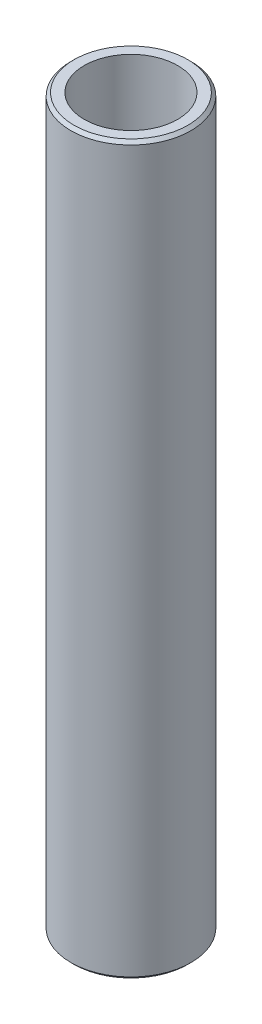
ISO-10303-21;
HEADER;
FILE_DESCRIPTION(('STEP AP214'),'2;1');
FILE_NAME('part.step','',(''),(''),'','','');
FILE_SCHEMA(('AUTOMOTIVE_DESIGN { 1 0 10303 214 1 1 1 1 }'));
ENDSEC;
DATA;
#1=APPLICATION_CONTEXT('core data for automotive mechanical design processes');
#2=APPLICATION_PROTOCOL_DEFINITION('international standard','automotive_design',2000,#1);
#3=PRODUCT_CONTEXT('',#1,'mechanical');
#4=PRODUCT('Part','Part','',(#3));
#5=PRODUCT_RELATED_PRODUCT_CATEGORY('part','',(#4));
#6=PRODUCT_DEFINITION_FORMATION('','',#4);
#7=PRODUCT_DEFINITION_CONTEXT('part definition',#1,'design');
#8=PRODUCT_DEFINITION('design','',#6,#7);
#9=PRODUCT_DEFINITION_SHAPE('','',#8);
#10=(LENGTH_UNIT() NAMED_UNIT(*) SI_UNIT(.MILLI.,.METRE.));
#11=(NAMED_UNIT(*) PLANE_ANGLE_UNIT() SI_UNIT($,.RADIAN.));
#12=(NAMED_UNIT(*) SI_UNIT($,.STERADIAN.) SOLID_ANGLE_UNIT());
#13=UNCERTAINTY_MEASURE_WITH_UNIT(LENGTH_MEASURE(1.E-05),#10,'distance_accuracy_value','');
#14=(GEOMETRIC_REPRESENTATION_CONTEXT(3) GLOBAL_UNCERTAINTY_ASSIGNED_CONTEXT((#13)) GLOBAL_UNIT_ASSIGNED_CONTEXT((#10,
#11,#12)) REPRESENTATION_CONTEXT('',''));
#15=CARTESIAN_POINT('',(0.,0.,0.));
#16=DIRECTION('',(0.,0.,1.));
#17=DIRECTION('',(1.,0.,0.));
#18=AXIS2_PLACEMENT_3D('',#15,#16,#17);
#19=CARTESIAN_POINT('',(0.,575.080637055339,0.));
#20=DIRECTION('',(0.,-1.,0.));
#21=DIRECTION('',(0.,0.,-1.));
#22=AXIS2_PLACEMENT_3D('',#19,#20,#21);
#23=CYLINDRICAL_SURFACE('',#22,47.5);
#24=CARTESIAN_POINT('',(0.,572.61060510153,0.));
#25=DIRECTION('',(0.,1.,0.));
#26=DIRECTION('',(0.,0.,1.));
#27=AXIS2_PLACEMENT_3D('',#24,#25,#26);
#28=CIRCLE('',#27,47.5);
#29=CARTESIAN_POINT('',(0.,572.61060510153,47.5));
#30=VERTEX_POINT('',#29);
#31=EDGE_CURVE('E50',#30,#30,#28,.F.);
#32=ORIENTED_EDGE('',*,*,#31,.T.);
#33=EDGE_LOOP('',(#32));
#34=FACE_BOUND('',#33,.T.);
#35=CARTESIAN_POINT('',(0.,2.47003195380902,0.));
#36=DIRECTION('',(0.,1.,0.));
#37=DIRECTION('',(0.,0.,1.));
#38=AXIS2_PLACEMENT_3D('',#35,#36,#37);
#39=CIRCLE('',#38,47.5);
#40=CARTESIAN_POINT('',(0.,2.47003195380902,47.5));
#41=VERTEX_POINT('',#40);
#42=EDGE_CURVE('E51',#41,#41,#39,.T.);
#43=ORIENTED_EDGE('',*,*,#42,.T.);
#44=EDGE_LOOP('',(#43));
#45=FACE_BOUND('',#44,.T.);
#46=ADVANCED_FACE('F39',(#34,#45),#23,.T.);
#47=CARTESIAN_POINT('',(0.,575.080637055339,0.));
#48=DIRECTION('',(0.,1.,0.));
#49=DIRECTION('',(0.,0.,1.));
#50=AXIS2_PLACEMENT_3D('',#47,#48,#49);
#51=PLANE('',#50);
#52=CARTESIAN_POINT('',(0.,575.080637055339,0.));
#53=DIRECTION('',(0.,1.,0.));
#54=DIRECTION('',(0.,0.,1.));
#55=AXIS2_PLACEMENT_3D('',#52,#53,#54);
#56=CIRCLE('',#55,45.0299680461909);
#57=CARTESIAN_POINT('',(0.,575.080637055339,45.0299680461909));
#58=VERTEX_POINT('',#57);
#59=EDGE_CURVE('E54',#58,#58,#56,.T.);
#60=ORIENTED_EDGE('',*,*,#59,.T.);
#61=EDGE_LOOP('',(#60));
#62=FACE_BOUND('',#61,.T.);
#63=CARTESIAN_POINT('',(0.,575.080637055339,0.));
#64=DIRECTION('',(0.,1.,0.));
#65=DIRECTION('',(0.,0.,1.));
#66=AXIS2_PLACEMENT_3D('',#63,#64,#65);
#67=CIRCLE('',#66,36.9737951186842);
#68=CARTESIAN_POINT('',(0.,575.080637055339,36.9737951186842));
#69=VERTEX_POINT('',#68);
#70=EDGE_CURVE('E58',#69,#69,#67,.T.);
#71=ORIENTED_EDGE('',*,*,#70,.F.);
#72=EDGE_LOOP('',(#71));
#73=FACE_BOUND('',#72,.T.);
#74=ADVANCED_FACE('F69',(#62,#73),#51,.T.);
#75=CARTESIAN_POINT('',(0.,0.,0.));
#76=DIRECTION('',(0.,1.,0.));
#77=DIRECTION('',(0.,0.,1.));
#78=AXIS2_PLACEMENT_3D('',#75,#76,#77);
#79=PLANE('',#78);
#80=CARTESIAN_POINT('',(0.,0.,0.));
#81=DIRECTION('',(0.,1.,0.));
#82=DIRECTION('',(0.,0.,1.));
#83=AXIS2_PLACEMENT_3D('',#80,#81,#82);
#84=CIRCLE('',#83,45.029968046191);
#85=CARTESIAN_POINT('',(0.,0.,45.029968046191));
#86=VERTEX_POINT('',#85);
#87=EDGE_CURVE('E10',#86,#86,#84,.F.);
#88=ORIENTED_EDGE('',*,*,#87,.T.);
#89=EDGE_LOOP('',(#88));
#90=FACE_BOUND('',#89,.T.);
#91=CARTESIAN_POINT('',(0.,0.,0.));
#92=DIRECTION('',(0.,1.,0.));
#93=DIRECTION('',(0.,0.,1.));
#94=AXIS2_PLACEMENT_3D('',#91,#92,#93);
#95=CIRCLE('',#94,36.9737951186842);
#96=CARTESIAN_POINT('',(0.,0.,36.9737951186842));
#97=VERTEX_POINT('',#96);
#98=EDGE_CURVE('E63',#97,#97,#95,.T.);
#99=ORIENTED_EDGE('',*,*,#98,.T.);
#100=EDGE_LOOP('',(#99));
#101=FACE_BOUND('',#100,.T.);
#102=ADVANCED_FACE('F75',(#90,#101),#79,.F.);
#103=CARTESIAN_POINT('',(0.,575.080637055339,0.));
#104=DIRECTION('',(0.,-1.,0.));
#105=DIRECTION('',(0.,0.,-1.));
#106=AXIS2_PLACEMENT_3D('',#103,#104,#105);
#107=CYLINDRICAL_SURFACE('',#106,36.9737951186842);
#108=ORIENTED_EDGE('',*,*,#70,.T.);
#109=EDGE_LOOP('',(#108));
#110=FACE_BOUND('',#109,.T.);
#111=ORIENTED_EDGE('',*,*,#98,.F.);
#112=EDGE_LOOP('',(#111));
#113=FACE_BOUND('',#112,.T.);
#114=ADVANCED_FACE('F70',(#110,#113),#107,.F.);
#115=CARTESIAN_POINT('',(0.,575.080637055339,0.));
#116=DIRECTION('',(0.,-1.,0.));
#117=DIRECTION('',(0.,0.,-1.));
#118=AXIS2_PLACEMENT_3D('',#115,#116,#117);
#119=CONICAL_SURFACE('',#118,45.0299680461909,0.785398163397419);
#120=ORIENTED_EDGE('',*,*,#31,.F.);
#121=EDGE_LOOP('',(#120));
#122=FACE_BOUND('',#121,.T.);
#123=ORIENTED_EDGE('',*,*,#59,.F.);
#124=EDGE_LOOP('',(#123));
#125=FACE_BOUND('',#124,.T.);
#126=ADVANCED_FACE('F81',(#122,#125),#119,.T.);
#127=CARTESIAN_POINT('',(0.,2.47003195380902,0.));
#128=DIRECTION('',(0.,1.,0.));
#129=DIRECTION('',(0.,0.,1.));
#130=AXIS2_PLACEMENT_3D('',#127,#128,#129);
#131=CONICAL_SURFACE('',#130,47.5,0.785398163397452);
#132=ORIENTED_EDGE('',*,*,#87,.F.);
#133=EDGE_LOOP('',(#132));
#134=FACE_BOUND('',#133,.T.);
#135=ORIENTED_EDGE('',*,*,#42,.F.);
#136=EDGE_LOOP('',(#135));
#137=FACE_BOUND('',#136,.T.);
#138=ADVANCED_FACE('F45',(#134,#137),#131,.T.);
#139=CLOSED_SHELL('',(#46,#74,#102,#114,#126,#138));
#140=MANIFOLD_SOLID_BREP('B2',#139);
#141=ADVANCED_BREP_SHAPE_REPRESENTATION('',(#18,#140),#14);
#142=SHAPE_DEFINITION_REPRESENTATION(#9,#141);
ENDSEC;
END-ISO-10303-21;
